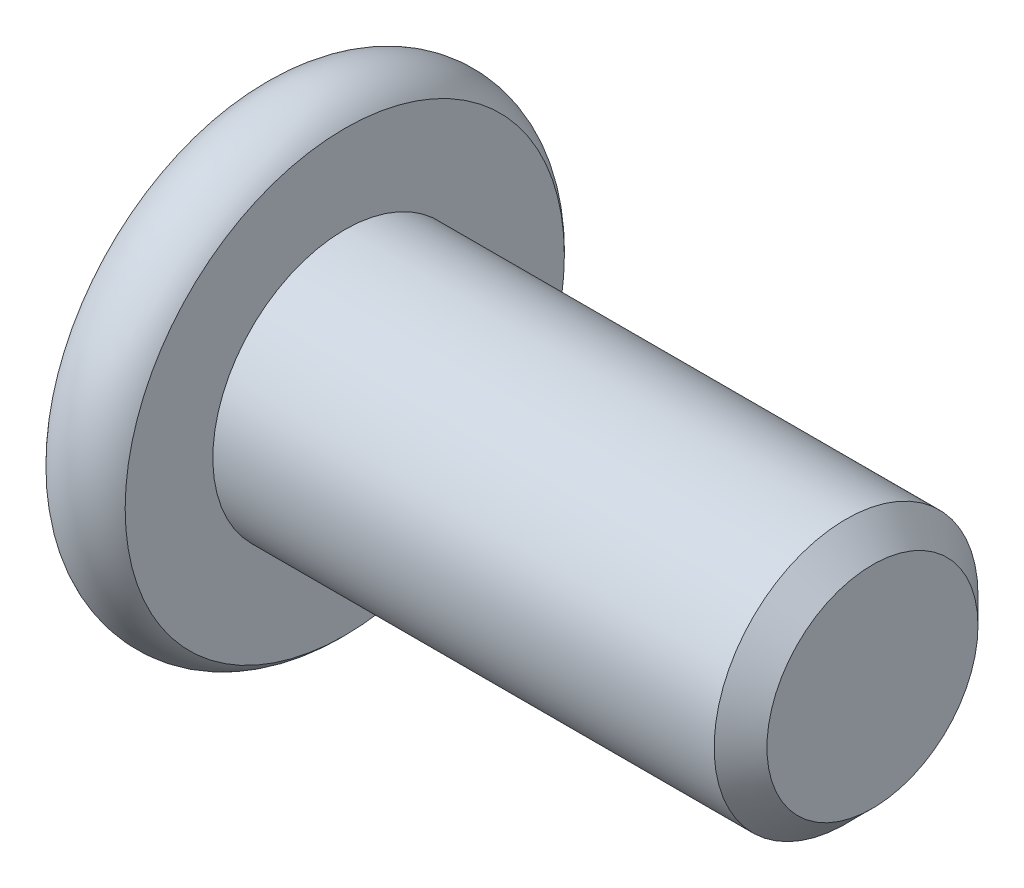
ISO-10303-21;
HEADER;
FILE_DESCRIPTION(('STEP AP214'),'2;1');
FILE_NAME('part.step','',(''),(''),'','','');
FILE_SCHEMA(('AUTOMOTIVE_DESIGN { 1 0 10303 214 1 1 1 1 }'));
ENDSEC;
DATA;
#1=APPLICATION_CONTEXT('core data for automotive mechanical design processes');
#2=APPLICATION_PROTOCOL_DEFINITION('international standard','automotive_design',2000,#1);
#3=PRODUCT_CONTEXT('',#1,'mechanical');
#4=PRODUCT('Part','Part','',(#3));
#5=PRODUCT_RELATED_PRODUCT_CATEGORY('part','',(#4));
#6=PRODUCT_DEFINITION_FORMATION('','',#4);
#7=PRODUCT_DEFINITION_CONTEXT('part definition',#1,'design');
#8=PRODUCT_DEFINITION('design','',#6,#7);
#9=PRODUCT_DEFINITION_SHAPE('','',#8);
#10=(LENGTH_UNIT() NAMED_UNIT(*) SI_UNIT(.MILLI.,.METRE.));
#11=(NAMED_UNIT(*) PLANE_ANGLE_UNIT() SI_UNIT($,.RADIAN.));
#12=(NAMED_UNIT(*) SI_UNIT($,.STERADIAN.) SOLID_ANGLE_UNIT());
#13=UNCERTAINTY_MEASURE_WITH_UNIT(LENGTH_MEASURE(1.E-05),#10,'distance_accuracy_value','');
#14=(GEOMETRIC_REPRESENTATION_CONTEXT(3) GLOBAL_UNCERTAINTY_ASSIGNED_CONTEXT((#13)) GLOBAL_UNIT_ASSIGNED_CONTEXT((#10,
#11,#12)) REPRESENTATION_CONTEXT('',''));
#15=CARTESIAN_POINT('',(0.,0.,0.));
#16=DIRECTION('',(0.,0.,1.));
#17=DIRECTION('',(1.,0.,0.));
#18=AXIS2_PLACEMENT_3D('',#15,#16,#17);
#19=CARTESIAN_POINT('',(-10.,0.,0.));
#20=DIRECTION('',(1.,0.,0.));
#21=DIRECTION('',(0.,0.,-1.));
#22=AXIS2_PLACEMENT_3D('',#19,#20,#21);
#23=CYLINDRICAL_SURFACE('',#22,2.5);
#24=CARTESIAN_POINT('',(-0.500000000000006,0.,0.));
#25=DIRECTION('',(1.,0.,0.));
#26=DIRECTION('',(0.,0.,-1.));
#27=AXIS2_PLACEMENT_3D('',#24,#25,#26);
#28=CIRCLE('',#27,2.5);
#29=CARTESIAN_POINT('',(-0.500000000000006,0.,-2.5));
#30=VERTEX_POINT('',#29);
#31=EDGE_CURVE('E48',#30,#30,#28,.F.);
#32=ORIENTED_EDGE('',*,*,#31,.T.);
#33=EDGE_LOOP('',(#32));
#34=FACE_BOUND('',#33,.T.);
#35=CARTESIAN_POINT('',(-10.,0.,0.));
#36=DIRECTION('',(1.,0.,0.));
#37=DIRECTION('',(0.,1.,0.));
#38=AXIS2_PLACEMENT_3D('',#35,#36,#37);
#39=CIRCLE('',#38,2.5);
#40=CARTESIAN_POINT('',(-10.,2.49999999999999,0.));
#41=VERTEX_POINT('',#40);
#42=EDGE_CURVE('E124',#41,#41,#39,.F.);
#43=ORIENTED_EDGE('',*,*,#42,.F.);
#44=EDGE_LOOP('',(#43));
#45=FACE_BOUND('',#44,.T.);
#46=ADVANCED_FACE('F35',(#34,#45),#23,.T.);
#47=CARTESIAN_POINT('',(0.,0.,0.));
#48=DIRECTION('',(1.,0.,0.));
#49=DIRECTION('',(0.,0.,-1.));
#50=AXIS2_PLACEMENT_3D('',#47,#48,#49);
#51=PLANE('',#50);
#52=CARTESIAN_POINT('',(0.,0.,0.));
#53=DIRECTION('',(1.,0.,0.));
#54=DIRECTION('',(0.,0.,-1.));
#55=AXIS2_PLACEMENT_3D('',#52,#53,#54);
#56=CIRCLE('',#55,1.99999999999999);
#57=CARTESIAN_POINT('',(0.,0.,-1.99999999999999));
#58=VERTEX_POINT('',#57);
#59=EDGE_CURVE('E127',#58,#58,#56,.T.);
#60=ORIENTED_EDGE('',*,*,#59,.T.);
#61=EDGE_LOOP('',(#60));
#62=FACE_BOUND('',#61,.T.);
#63=ADVANCED_FACE('F137',(#62),#51,.T.);
#64=CARTESIAN_POINT('',(0.,0.,0.));
#65=DIRECTION('',(-1.,0.,0.));
#66=DIRECTION('',(0.,0.,1.));
#67=AXIS2_PLACEMENT_3D('',#64,#65,#66);
#68=CONICAL_SURFACE('',#67,1.99999999999999,0.785398163397446);
#69=ORIENTED_EDGE('',*,*,#31,.F.);
#70=EDGE_LOOP('',(#69));
#71=FACE_BOUND('',#70,.T.);
#72=ORIENTED_EDGE('',*,*,#59,.F.);
#73=EDGE_LOOP('',(#72));
#74=FACE_BOUND('',#73,.T.);
#75=ADVANCED_FACE('F37',(#71,#74),#68,.T.);
#76=CARTESIAN_POINT('',(-11.5,0.,0.));
#77=DIRECTION('',(-1.,0.,0.));
#78=DIRECTION('',(0.,-1.,0.));
#79=AXIS2_PLACEMENT_3D('',#76,#77,#78);
#80=PLANE('',#79);
#81=CARTESIAN_POINT('',(-11.5,0.,0.));
#82=DIRECTION('',(-1.,0.,0.));
#83=DIRECTION('',(0.,-1.,0.));
#84=AXIS2_PLACEMENT_3D('',#81,#82,#83);
#85=CIRCLE('',#84,1.78205080756886);
#86=CARTESIAN_POINT('',(-11.5,-1.78205080756882,0.));
#87=VERTEX_POINT('',#86);
#88=EDGE_CURVE('E237',#87,#87,#85,.T.);
#89=ORIENTED_EDGE('',*,*,#88,.F.);
#90=EDGE_LOOP('',(#89));
#91=FACE_BOUND('',#90,.T.);
#92=CARTESIAN_POINT('',(-11.5,0.,0.));
#93=DIRECTION('',(1.,0.,0.));
#94=DIRECTION('',(0.,1.,0.));
#95=AXIS2_PLACEMENT_3D('',#92,#93,#94);
#96=CIRCLE('',#95,4.16143782776615);
#97=CARTESIAN_POINT('',(-11.5,4.16143782776615,0.));
#98=VERTEX_POINT('',#97);
#99=EDGE_CURVE('E121',#98,#98,#96,.T.);
#100=ORIENTED_EDGE('',*,*,#99,.F.);
#101=EDGE_LOOP('',(#100));
#102=FACE_BOUND('',#101,.T.);
#103=ADVANCED_FACE('F136',(#91,#102),#80,.T.);
#104=CARTESIAN_POINT('',(-10.75,0.,0.));
#105=DIRECTION('',(1.,0.,0.));
#106=DIRECTION('',(0.,1.,0.));
#107=AXIS2_PLACEMENT_3D('',#104,#105,#106);
#108=TOROIDAL_SURFACE('',#107,3.5,1.);
#109=ORIENTED_EDGE('',*,*,#99,.T.);
#110=EDGE_LOOP('',(#109));
#111=FACE_BOUND('',#110,.T.);
#112=CARTESIAN_POINT('',(-10.,0.,0.));
#113=DIRECTION('',(1.,0.,0.));
#114=DIRECTION('',(0.,1.,0.));
#115=AXIS2_PLACEMENT_3D('',#112,#113,#114);
#116=CIRCLE('',#115,4.16143782776615);
#117=CARTESIAN_POINT('',(-10.,4.16143782776615,0.));
#118=VERTEX_POINT('',#117);
#119=EDGE_CURVE('E118',#118,#118,#116,.T.);
#120=ORIENTED_EDGE('',*,*,#119,.F.);
#121=EDGE_LOOP('',(#120));
#122=FACE_BOUND('',#121,.T.);
#123=ADVANCED_FACE('F148',(#111,#122),#108,.T.);
#124=CARTESIAN_POINT('',(-10.,4.16143782776615,0.));
#125=DIRECTION('',(1.,0.,0.));
#126=DIRECTION('',(0.,1.,0.));
#127=AXIS2_PLACEMENT_3D('',#124,#125,#126);
#128=PLANE('',#127);
#129=ORIENTED_EDGE('',*,*,#42,.T.);
#130=EDGE_LOOP('',(#129));
#131=FACE_BOUND('',#130,.T.);
#132=ORIENTED_EDGE('',*,*,#119,.T.);
#133=EDGE_LOOP('',(#132));
#134=FACE_BOUND('',#133,.T.);
#135=ADVANCED_FACE('F152',(#131,#134),#128,.T.);
#136=CARTESIAN_POINT('',(-11.5,0.,0.));
#137=DIRECTION('',(-1.,0.,0.));
#138=DIRECTION('',(0.,-1.,0.));
#139=AXIS2_PLACEMENT_3D('',#136,#137,#138);
#140=CONICAL_SURFACE('',#139,1.78205080756886,0.78539816339745);
#141=ORIENTED_EDGE('',*,*,#88,.T.);
#142=EDGE_LOOP('',(#141));
#143=FACE_BOUND('',#142,.T.);
#144=CARTESIAN_POINT('',(-12.015428085613,-1.74023253176578,1.5));
#145=CARTESIAN_POINT('',(-11.9833811073445,-1.69791724929731,1.5));
#146=CARTESIAN_POINT('',(-11.9516444672841,-1.65536760966792,1.5));
#147=CARTESIAN_POINT('',(-11.8889203936153,-1.56970398156685,1.5));
#148=CARTESIAN_POINT('',(-11.85793314822,-1.52658985542849,1.5));
#149=CARTESIAN_POINT('',(-11.765846164345,-1.39562626326563,1.5));
#150=CARTESIAN_POINT('',(-11.7061145123021,-1.30679868010576,1.5));
#151=CARTESIAN_POINT('',(-11.5887342891012,-1.12044622640215,1.5));
#152=CARTESIAN_POINT('',(-11.5314082774823,-1.02271587306673,1.5));
#153=CARTESIAN_POINT('',(-11.426463214976,-0.822357214965257,1.5));
#154=CARTESIAN_POINT('',(-11.3788114236896,-0.71974693170192,1.5));
#155=CARTESIAN_POINT('',(-11.320509988315,-0.565852387095093,1.5));
#156=CARTESIAN_POINT('',(-11.3037990535409,-0.516874191424681,1.5));
#157=CARTESIAN_POINT('',(-11.2743077515089,-0.41772398845752,1.5));
#158=CARTESIAN_POINT('',(-11.2615276514219,-0.367551900263886,1.5));
#159=CARTESIAN_POINT('',(-11.2407784202458,-0.267158299056137,1.5));
#160=CARTESIAN_POINT('',(-11.2327260618259,-0.216954261864873,1.5));
#161=CARTESIAN_POINT('',(-11.221591636834,-0.115994915871338,1.5));
#162=CARTESIAN_POINT('',(-11.2185086886377,-0.0652397064615559,1.5));
#163=CARTESIAN_POINT('',(-11.2175473897404,0.0344222234875402,1.5));
#164=CARTESIAN_POINT('',(-11.2194789216952,0.0833271701100743,1.5));
#165=CARTESIAN_POINT('',(-11.2280175729677,0.180724293127207,1.5));
#166=CARTESIAN_POINT('',(-11.234625142048,0.229216429361715,1.5));
#167=CARTESIAN_POINT('',(-11.2522650626447,0.326258027696994,1.5));
#168=CARTESIAN_POINT('',(-11.263373168201,0.374793507450014,1.5));
#169=CARTESIAN_POINT('',(-11.2894198669595,0.470802295834168,1.5));
#170=CARTESIAN_POINT('',(-11.3043581560035,0.518275688481272,1.5));
#171=CARTESIAN_POINT('',(-11.356839545716,0.667150562065121,1.5));
#172=CARTESIAN_POINT('',(-11.4003351165442,0.76644836242684,1.5));
#173=CARTESIAN_POINT('',(-11.4970587814836,0.960384405673826,1.5));
#174=CARTESIAN_POINT('',(-11.5503217226675,1.0550043738362,1.5));
#175=CARTESIAN_POINT('',(-11.6602258010453,1.23584520321531,1.5));
#176=CARTESIAN_POINT('',(-11.7165682531046,1.32224986946549,1.5));
#177=CARTESIAN_POINT('',(-11.803675572597,1.44954953726472,1.5));
#178=CARTESIAN_POINT('',(-11.8330199906839,1.49143368482422,1.5));
#179=CARTESIAN_POINT('',(-11.8924869182931,1.57462914783243,1.5));
#180=CARTESIAN_POINT('',(-11.9226092115007,1.61594061772578,1.5));
#181=CARTESIAN_POINT('',(-11.9530541181366,1.65701358742552,1.5));
#182=B_SPLINE_CURVE_WITH_KNOTS('',3,(#144,#145,#146,#147,#148,#149,#150,#151,#152,#153,#154,
#155,#156,#157,#158,#159,#160,#161,#162,#163,#164,#165,#166,#167,#168,#169,#170,#171,#172,#173,
#174,#175,#176,#177,#178,#179,#180,#181),.UNSPECIFIED.,.F.,.F.,(4,2,2,2,2,2,2,2,2,2,2,2,2,2,2,2,
2,2,4),(0.,0.159238974218354,0.318517535014543,0.639504781932391,0.979137893799203,
1.31760168934357,1.47272233841624,1.62785352839776,1.78016486537347,1.93244917778279,
2.07904486260298,2.22565464958333,2.37484213303399,2.5240177730404,2.84828365283776,
3.1737297566675,3.48303030530537,3.63644667013909,3.78982082222913),.UNSPECIFIED.);
#183=CARTESIAN_POINT('',(-11.45,-0.866025403784395,1.5));
#184=VERTEX_POINT('',#183);
#185=CARTESIAN_POINT('',(-11.45,0.866025403784483,1.5));
#186=VERTEX_POINT('',#185);
#187=EDGE_CURVE('E102',#184,#186,#182,.T.);
#188=ORIENTED_EDGE('',*,*,#187,.F.);
#189=CARTESIAN_POINT('',(-11.4501154816001,-1.73216627762267,-0.000200000000000713));
#190=CARTESIAN_POINT('',(-11.4203654760674,-1.70239359975911,0.0513677907370752));
#191=CARTESIAN_POINT('',(-11.3923624839103,-1.67212305186351,0.103797917665201));
#192=CARTESIAN_POINT('',(-11.3410892304402,-1.61039789003615,0.210709034055597));
#193=CARTESIAN_POINT('',(-11.3178475050444,-1.5789374031261,0.265200195814661));
#194=CARTESIAN_POINT('',(-11.2780337289922,-1.51549879897983,0.375079081357248));
#195=CARTESIAN_POINT('',(-11.2613615856709,-1.48353684526806,0.430438809095199));
#196=CARTESIAN_POINT('',(-11.2356744568181,-1.41890915196207,0.542377257477151));
#197=CARTESIAN_POINT('',(-11.2266402904789,-1.38624538781114,0.598952556553009));
#198=CARTESIAN_POINT('',(-11.2184890812269,-1.32995210095295,0.696455389516441));
#199=CARTESIAN_POINT('',(-11.2172822529892,-1.3063953331112,0.737256908280466));
#200=CARTESIAN_POINT('',(-11.2193140571623,-1.25932335290189,0.818787969615858));
#201=CARTESIAN_POINT('',(-11.2225536707483,-1.23580815085309,0.85951749431463));
#202=CARTESIAN_POINT('',(-11.233291985982,-1.18900414978422,0.940584402163416));
#203=CARTESIAN_POINT('',(-11.2407946530188,-1.16571558211715,0.980921384598288));
#204=CARTESIAN_POINT('',(-11.2596516119283,-1.11952932016331,1.06091833691403));
#205=CARTESIAN_POINT('',(-11.2710075570186,-1.09663179808782,1.10057800851621));
#206=CARTESIAN_POINT('',(-11.3047216475927,-1.03798159809694,1.20216313477448));
#207=CARTESIAN_POINT('',(-11.3296218490934,-1.00259267147461,1.26345855370969));
#208=CARTESIAN_POINT('',(-11.3716566532716,-0.950557780604331,1.35358562846331));
#209=CARTESIAN_POINT('',(-11.3864251535591,-0.933410759677104,1.38328513990772));
#210=CARTESIAN_POINT('',(-11.4173105659402,-0.899432101996364,1.44213790138375));
#211=CARTESIAN_POINT('',(-11.4334268341217,-0.882600319285667,1.47129140422064));
#212=CARTESIAN_POINT('',(-11.4501154816001,-0.865909933730557,1.5002));
#213=B_SPLINE_CURVE_WITH_KNOTS('',3,(#189,#190,#191,#192,#193,#194,#195,#196,#197,#198,#199,
#200,#201,#202,#203,#204,#205,#206,#207,#208,#209,#210,#211,#212),.UNSPECIFIED.,.F.,.F.,(4,2,2,
2,2,2,2,2,2,2,2,4),(0.,0.199829143693305,0.400822987382389,0.598623720538181,0.79592624018889,
0.937113067959882,1.07833105577193,1.21968061668222,1.36109089931054,1.58570969637565,
1.69770705470964,1.80965120737194),.UNSPECIFIED.);
#214=CARTESIAN_POINT('',(-11.45,-1.73205080756883,0.));
#215=VERTEX_POINT('',#214);
#216=EDGE_CURVE('E194',#215,#184,#213,.T.);
#217=ORIENTED_EDGE('',*,*,#216,.F.);
#218=CARTESIAN_POINT('',(-11.4501154816001,-0.865909933730557,-1.5002));
#219=CARTESIAN_POINT('',(-11.4203654760673,-0.895682611594122,-1.44863220926292));
#220=CARTESIAN_POINT('',(-11.3923624839103,-0.925953159489721,-1.3962020823348));
#221=CARTESIAN_POINT('',(-11.3410892304402,-0.98767832131708,-1.2892909659444));
#222=CARTESIAN_POINT('',(-11.3178475050444,-1.01913880822713,-1.23479980418534));
#223=CARTESIAN_POINT('',(-11.2780337289922,-1.0825774123734,-1.12492091864275));
#224=CARTESIAN_POINT('',(-11.2613615856709,-1.11453936608517,-1.0695611909048));
#225=CARTESIAN_POINT('',(-11.2356744568181,-1.17916705939116,-0.957622742522848));
#226=CARTESIAN_POINT('',(-11.2266402904789,-1.21183082354209,-0.90104744344699));
#227=CARTESIAN_POINT('',(-11.2184890812269,-1.26812411040028,-0.803544610483558));
#228=CARTESIAN_POINT('',(-11.2172822529892,-1.29168087824203,-0.762743091719532));
#229=CARTESIAN_POINT('',(-11.2193140571623,-1.33875285845134,-0.68121203038414));
#230=CARTESIAN_POINT('',(-11.2225536707483,-1.36226806050014,-0.640482505685369));
#231=CARTESIAN_POINT('',(-11.233291985982,-1.40907206156901,-0.559415597836583));
#232=CARTESIAN_POINT('',(-11.2407946530188,-1.43236062923608,-0.519078615401711));
#233=CARTESIAN_POINT('',(-11.2596516119283,-1.47854689118992,-0.439081663085968));
#234=CARTESIAN_POINT('',(-11.2710075570186,-1.50144441326541,-0.399421991483791));
#235=CARTESIAN_POINT('',(-11.3047216475927,-1.56009461325629,-0.297836865225514));
#236=CARTESIAN_POINT('',(-11.3296218490934,-1.59548353987862,-0.23654144629031));
#237=CARTESIAN_POINT('',(-11.3716566532716,-1.6475184307489,-0.146414371536686));
#238=CARTESIAN_POINT('',(-11.3864251535591,-1.66466545167613,-0.116714860092282));
#239=CARTESIAN_POINT('',(-11.4173105659402,-1.69864410935687,-0.0578620986162491));
#240=CARTESIAN_POINT('',(-11.4334268341217,-1.71547589206756,-0.0287085957793631));
#241=CARTESIAN_POINT('',(-11.4501154816001,-1.73216627762267,0.000199999999999294));
#242=B_SPLINE_CURVE_WITH_KNOTS('',3,(#218,#219,#220,#221,#222,#223,#224,#225,#226,#227,#228,
#229,#230,#231,#232,#233,#234,#235,#236,#237,#238,#239,#240,#241),.UNSPECIFIED.,.F.,.F.,(4,2,2,
2,2,2,2,2,2,2,2,4),(0.,0.199829143693305,0.40082298738239,0.598623720538182,0.795926240188891,
0.937113067959883,1.07833105577193,1.21968061668222,1.36109089931055,1.58570969637566,
1.69770705470964,1.80965120737194),.UNSPECIFIED.);
#243=CARTESIAN_POINT('',(-11.45,-0.866025403784394,-1.5));
#244=VERTEX_POINT('',#243);
#245=EDGE_CURVE('E189',#244,#215,#242,.T.);
#246=ORIENTED_EDGE('',*,*,#245,.F.);
#247=CARTESIAN_POINT('',(-12.015428085613,-1.74023253176577,-1.5));
#248=CARTESIAN_POINT('',(-11.9833811073445,-1.69791724929731,-1.5));
#249=CARTESIAN_POINT('',(-11.9516444672841,-1.65536760966792,-1.5));
#250=CARTESIAN_POINT('',(-11.8889203936153,-1.56970398156685,-1.5));
#251=CARTESIAN_POINT('',(-11.85793314822,-1.52658985542849,-1.5));
#252=CARTESIAN_POINT('',(-11.765846164345,-1.39562626326563,-1.5));
#253=CARTESIAN_POINT('',(-11.7061145123021,-1.30679868010576,-1.5));
#254=CARTESIAN_POINT('',(-11.5887342891012,-1.12044622640215,-1.5));
#255=CARTESIAN_POINT('',(-11.5314082774823,-1.02271587306672,-1.5));
#256=CARTESIAN_POINT('',(-11.426463214976,-0.822357214965256,-1.5));
#257=CARTESIAN_POINT('',(-11.3788114236896,-0.719746931701919,-1.5));
#258=CARTESIAN_POINT('',(-11.320509988315,-0.565852387095092,-1.5));
#259=CARTESIAN_POINT('',(-11.3037990535409,-0.51687419142468,-1.5));
#260=CARTESIAN_POINT('',(-11.2743077515089,-0.417723988457519,-1.5));
#261=CARTESIAN_POINT('',(-11.2615276514219,-0.367551900263885,-1.5));
#262=CARTESIAN_POINT('',(-11.2407784202458,-0.267158299056136,-1.5));
#263=CARTESIAN_POINT('',(-11.2327260618259,-0.216954261864872,-1.5));
#264=CARTESIAN_POINT('',(-11.221591636834,-0.115994915871338,-1.5));
#265=CARTESIAN_POINT('',(-11.2185086886377,-0.0652397064615554,-1.5));
#266=CARTESIAN_POINT('',(-11.2175473897404,0.0344222234875406,-1.5));
#267=CARTESIAN_POINT('',(-11.2194789216952,0.0833271701100747,-1.5));
#268=CARTESIAN_POINT('',(-11.2280175729677,0.180724293127208,-1.5));
#269=CARTESIAN_POINT('',(-11.234625142048,0.229216429361715,-1.5));
#270=CARTESIAN_POINT('',(-11.2522650626447,0.326258027696995,-1.5));
#271=CARTESIAN_POINT('',(-11.263373168201,0.374793507450015,-1.5));
#272=CARTESIAN_POINT('',(-11.2894198669595,0.470802295834169,-1.5));
#273=CARTESIAN_POINT('',(-11.3043581560035,0.518275688481272,-1.5));
#274=CARTESIAN_POINT('',(-11.356839545716,0.667150562065121,-1.5));
#275=CARTESIAN_POINT('',(-11.4003351165442,0.766448362426841,-1.5));
#276=CARTESIAN_POINT('',(-11.4970587814836,0.960384405673827,-1.5));
#277=CARTESIAN_POINT('',(-11.5503217226675,1.0550043738362,-1.5));
#278=CARTESIAN_POINT('',(-11.6602258010453,1.23584520321531,-1.5));
#279=CARTESIAN_POINT('',(-11.7165682531046,1.32224986946549,-1.5));
#280=CARTESIAN_POINT('',(-11.803675572597,1.44954953726472,-1.5));
#281=CARTESIAN_POINT('',(-11.8330199906839,1.49143368482422,-1.5));
#282=CARTESIAN_POINT('',(-11.8924869182931,1.57462914783243,-1.5));
#283=CARTESIAN_POINT('',(-11.9226092115007,1.61594061772578,-1.5));
#284=CARTESIAN_POINT('',(-11.9530541181366,1.65701358742552,-1.5));
#285=B_SPLINE_CURVE_WITH_KNOTS('',3,(#247,#248,#249,#250,#251,#252,#253,#254,#255,#256,#257,
#258,#259,#260,#261,#262,#263,#264,#265,#266,#267,#268,#269,#270,#271,#272,#273,#274,#275,#276,
#277,#278,#279,#280,#281,#282,#283,#284),.UNSPECIFIED.,.F.,.F.,(4,2,2,2,2,2,2,2,2,2,2,2,2,2,2,2,
2,2,4),(0.,0.159238974218353,0.318517535014542,0.639504781932388,0.979137893799199,
1.31760168934357,1.47272233841624,1.62785352839775,1.78016486537346,1.93244917778279,
2.07904486260297,2.22565464958332,2.37484213303399,2.5240177730404,2.84828365283775,
3.1737297566675,3.48303030530537,3.63644667013908,3.78982082222912),.UNSPECIFIED.);
#286=CARTESIAN_POINT('',(-11.45,0.866025403784483,-1.5));
#287=VERTEX_POINT('',#286);
#288=EDGE_CURVE('E55',#287,#244,#285,.F.);
#289=ORIENTED_EDGE('',*,*,#288,.F.);
#290=CARTESIAN_POINT('',(-11.4501154816001,1.73216627762276,0.000200000000000434));
#291=CARTESIAN_POINT('',(-11.4203654760673,1.70239359975919,-0.0513677907370751));
#292=CARTESIAN_POINT('',(-11.3923624839103,1.67212305186359,-0.1037979176652));
#293=CARTESIAN_POINT('',(-11.3410892304402,1.61039789003624,-0.210709034055596));
#294=CARTESIAN_POINT('',(-11.3178475050444,1.57893740312618,-0.265200195814661));
#295=CARTESIAN_POINT('',(-11.2780337289922,1.51549879897992,-0.375079081357248));
#296=CARTESIAN_POINT('',(-11.2613615856709,1.48353684526815,-0.430438809095199));
#297=CARTESIAN_POINT('',(-11.2356744568181,1.41890915196216,-0.54237725747715));
#298=CARTESIAN_POINT('',(-11.2266402904789,1.38624538781123,-0.598952556553008));
#299=CARTESIAN_POINT('',(-11.2184890812269,1.32995210095304,-0.69645538951644));
#300=CARTESIAN_POINT('',(-11.2172822529892,1.30639533311128,-0.737256908280466));
#301=CARTESIAN_POINT('',(-11.2193140571623,1.25932335290198,-0.818787969615858));
#302=CARTESIAN_POINT('',(-11.2225536707483,1.23580815085318,-0.859517494314629));
#303=CARTESIAN_POINT('',(-11.233291985982,1.18900414978431,-0.940584402163415));
#304=CARTESIAN_POINT('',(-11.2407946530187,1.16571558211724,-0.980921384598287));
#305=CARTESIAN_POINT('',(-11.2596516119283,1.1195293201634,-1.06091833691403));
#306=CARTESIAN_POINT('',(-11.2710075570186,1.09663179808791,-1.10057800851621));
#307=CARTESIAN_POINT('',(-11.3047216475927,1.03798159809703,-1.20216313477448));
#308=CARTESIAN_POINT('',(-11.3296218490934,1.0025926714747,-1.26345855370969));
#309=CARTESIAN_POINT('',(-11.3716566532716,0.950557780604418,-1.35358562846331));
#310=CARTESIAN_POINT('',(-11.3864251535591,0.933410759677191,-1.38328513990772));
#311=CARTESIAN_POINT('',(-11.4173105659402,0.899432101996451,-1.44213790138375));
#312=CARTESIAN_POINT('',(-11.4334268341217,0.882600319285755,-1.47129140422064));
#313=CARTESIAN_POINT('',(-11.4501154816001,0.865909933730645,-1.5002));
#314=B_SPLINE_CURVE_WITH_KNOTS('',3,(#290,#291,#292,#293,#294,#295,#296,#297,#298,#299,#300,
#301,#302,#303,#304,#305,#306,#307,#308,#309,#310,#311,#312,#313),.UNSPECIFIED.,.F.,.F.,(4,2,2,
2,2,2,2,2,2,2,2,4),(0.,0.199829143693305,0.400822987382389,0.598623720538181,0.795926240188889,
0.937113067959881,1.07833105577193,1.21968061668222,1.36109089931054,1.58570969637565,
1.69770705470964,1.80965120737194),.UNSPECIFIED.);
#315=CARTESIAN_POINT('',(-11.45,1.73205080756892,0.));
#316=VERTEX_POINT('',#315);
#317=EDGE_CURVE('E11',#316,#287,#314,.T.);
#318=ORIENTED_EDGE('',*,*,#317,.F.);
#319=CARTESIAN_POINT('',(-11.4501154816001,0.865909933730645,1.5002));
#320=CARTESIAN_POINT('',(-11.4203654760673,0.89568261159421,1.44863220926292));
#321=CARTESIAN_POINT('',(-11.3923624839103,0.925953159489809,1.3962020823348));
#322=CARTESIAN_POINT('',(-11.3410892304402,0.987678321317167,1.2892909659444));
#323=CARTESIAN_POINT('',(-11.3178475050444,1.01913880822722,1.23479980418534));
#324=CARTESIAN_POINT('',(-11.2780337289922,1.08257741237349,1.12492091864275));
#325=CARTESIAN_POINT('',(-11.2613615856709,1.11453936608526,1.0695611909048));
#326=CARTESIAN_POINT('',(-11.2356744568181,1.17916705939125,0.957622742522851));
#327=CARTESIAN_POINT('',(-11.2266402904789,1.21183082354218,0.901047443446993));
#328=CARTESIAN_POINT('',(-11.2184890812269,1.26812411040036,0.803544610483561));
#329=CARTESIAN_POINT('',(-11.2172822529892,1.29168087824212,0.762743091719535));
#330=CARTESIAN_POINT('',(-11.2193140571623,1.33875285845142,0.681212030384143));
#331=CARTESIAN_POINT('',(-11.2225536707483,1.36226806050023,0.640482505685371));
#332=CARTESIAN_POINT('',(-11.233291985982,1.40907206156909,0.559415597836585));
#333=CARTESIAN_POINT('',(-11.2407946530187,1.43236062923616,0.519078615401713));
#334=CARTESIAN_POINT('',(-11.2596516119283,1.47854689119001,0.43908166308597));
#335=CARTESIAN_POINT('',(-11.2710075570186,1.5014444132655,0.399421991483793));
#336=CARTESIAN_POINT('',(-11.3047216475927,1.56009461325637,0.297836865225516));
#337=CARTESIAN_POINT('',(-11.3296218490934,1.59548353987871,0.236541446290312));
#338=CARTESIAN_POINT('',(-11.3716566532716,1.64751843074898,0.146414371536687));
#339=CARTESIAN_POINT('',(-11.3864251535591,1.66466545167621,0.116714860092283));
#340=CARTESIAN_POINT('',(-11.4173105659402,1.69864410935695,0.0578620986162497));
#341=CARTESIAN_POINT('',(-11.4334268341217,1.71547589206765,0.0287085957793635));
#342=CARTESIAN_POINT('',(-11.4501154816001,1.73216627762276,-0.000199999999999224));
#343=B_SPLINE_CURVE_WITH_KNOTS('',3,(#319,#320,#321,#322,#323,#324,#325,#326,#327,#328,#329,
#330,#331,#332,#333,#334,#335,#336,#337,#338,#339,#340,#341,#342),.UNSPECIFIED.,.F.,.F.,(4,2,2,
2,2,2,2,2,2,2,2,4),(0.,0.199829143693304,0.400822987382388,0.598623720538179,0.795926240188887,
0.937113067959879,1.07833105577193,1.21968061668222,1.36109089931054,1.58570969637565,
1.69770705470963,1.80965120737194),.UNSPECIFIED.);
#344=EDGE_CURVE('E93',#186,#316,#343,.T.);
#345=ORIENTED_EDGE('',*,*,#344,.F.);
#346=EDGE_LOOP('',(#188,#217,#246,#289,#318,#345));
#347=FACE_BOUND('',#346,.T.);
#348=ADVANCED_FACE('F92',(#143,#347),#140,.F.);
#349=CARTESIAN_POINT('',(-9.2,0.,0.));
#350=DIRECTION('',(-1.,0.,0.));
#351=DIRECTION('',(0.,-1.,0.));
#352=AXIS2_PLACEMENT_3D('',#349,#350,#351);
#353=PLANE('',#352);
#354=DIRECTION('',(0.,0.5,-0.866025403784439));
#355=VECTOR('',#354,1.);
#356=CARTESIAN_POINT('',(-9.2,0.866025403784474,1.5));
#357=LINE('',#356,#355);
#358=CARTESIAN_POINT('',(-9.2,0.866025403784474,1.5));
#359=VERTEX_POINT('',#358);
#360=CARTESIAN_POINT('',(-9.19999999999999,1.73205080756891,0.));
#361=VERTEX_POINT('',#360);
#362=EDGE_CURVE('E101',#359,#361,#357,.T.);
#363=ORIENTED_EDGE('',*,*,#362,.T.);
#364=DIRECTION('',(0.,-0.5,-0.866025403784439));
#365=VECTOR('',#364,1.);
#366=CARTESIAN_POINT('',(-9.19999999999999,1.73205080756891,0.));
#367=LINE('',#366,#365);
#368=CARTESIAN_POINT('',(-9.2,0.866025403784474,-1.5));
#369=VERTEX_POINT('',#368);
#370=EDGE_CURVE('E106',#361,#369,#367,.T.);
#371=ORIENTED_EDGE('',*,*,#370,.T.);
#372=DIRECTION('',(0.,-1.,0.));
#373=VECTOR('',#372,1.);
#374=CARTESIAN_POINT('',(-9.2,0.866025403784474,-1.5));
#375=LINE('',#374,#373);
#376=CARTESIAN_POINT('',(-9.2,-0.866025403784403,-1.5));
#377=VERTEX_POINT('',#376);
#378=EDGE_CURVE('E219',#369,#377,#375,.T.);
#379=ORIENTED_EDGE('',*,*,#378,.T.);
#380=DIRECTION('',(0.,-0.5,0.866025403784438));
#381=VECTOR('',#380,1.);
#382=CARTESIAN_POINT('',(-9.2,-0.866025403784403,-1.5));
#383=LINE('',#382,#381);
#384=CARTESIAN_POINT('',(-9.20000000000001,-1.73205080756884,0.));
#385=VERTEX_POINT('',#384);
#386=EDGE_CURVE('E223',#377,#385,#383,.T.);
#387=ORIENTED_EDGE('',*,*,#386,.T.);
#388=DIRECTION('',(0.,0.5,0.866025403784439));
#389=VECTOR('',#388,1.);
#390=CARTESIAN_POINT('',(-9.20000000000001,-1.73205080756884,0.));
#391=LINE('',#390,#389);
#392=CARTESIAN_POINT('',(-9.2,-0.866025403784404,1.5));
#393=VERTEX_POINT('',#392);
#394=EDGE_CURVE('E114',#385,#393,#391,.T.);
#395=ORIENTED_EDGE('',*,*,#394,.T.);
#396=DIRECTION('',(0.,1.,0.));
#397=VECTOR('',#396,1.);
#398=CARTESIAN_POINT('',(-9.2,-0.866025403784404,1.5));
#399=LINE('',#398,#397);
#400=EDGE_CURVE('E109',#393,#359,#399,.T.);
#401=ORIENTED_EDGE('',*,*,#400,.T.);
#402=EDGE_LOOP('',(#363,#371,#379,#387,#395,#401));
#403=FACE_BOUND('',#402,.T.);
#404=ADVANCED_FACE('F176',(#403),#353,.T.);
#405=CARTESIAN_POINT('',(-9.19999999999999,1.73205080756891,0.));
#406=DIRECTION('',(0.,0.866025403784439,-0.5));
#407=DIRECTION('',(0.,0.5,0.866025403784439));
#408=AXIS2_PLACEMENT_3D('',#405,#406,#407);
#409=PLANE('',#408);
#410=DIRECTION('',(-1.,0.,0.));
#411=VECTOR('',#410,1.);
#412=CARTESIAN_POINT('',(-9.19999999999999,1.73205080756891,0.));
#413=LINE('',#412,#411);
#414=EDGE_CURVE('E99',#361,#316,#413,.T.);
#415=ORIENTED_EDGE('',*,*,#414,.T.);
#416=ORIENTED_EDGE('',*,*,#317,.T.);
#417=DIRECTION('',(-1.,0.,0.));
#418=VECTOR('',#417,1.);
#419=CARTESIAN_POINT('',(-9.2,0.866025403784474,-1.5));
#420=LINE('',#419,#418);
#421=EDGE_CURVE('E108',#369,#287,#420,.T.);
#422=ORIENTED_EDGE('',*,*,#421,.F.);
#423=ORIENTED_EDGE('',*,*,#370,.F.);
#424=EDGE_LOOP('',(#415,#416,#422,#423));
#425=FACE_BOUND('',#424,.T.);
#426=ADVANCED_FACE('F104',(#425),#409,.F.);
#427=CARTESIAN_POINT('',(-9.2,0.866025403784474,-1.5));
#428=DIRECTION('',(0.,0.,-1.));
#429=DIRECTION('',(-1.,0.,0.));
#430=AXIS2_PLACEMENT_3D('',#427,#428,#429);
#431=PLANE('',#430);
#432=ORIENTED_EDGE('',*,*,#421,.T.);
#433=ORIENTED_EDGE('',*,*,#288,.T.);
#434=DIRECTION('',(-1.,0.,0.));
#435=VECTOR('',#434,1.);
#436=CARTESIAN_POINT('',(-9.2,-0.866025403784403,-1.5));
#437=LINE('',#436,#435);
#438=EDGE_CURVE('E111',#377,#244,#437,.T.);
#439=ORIENTED_EDGE('',*,*,#438,.F.);
#440=ORIENTED_EDGE('',*,*,#378,.F.);
#441=EDGE_LOOP('',(#432,#433,#439,#440));
#442=FACE_BOUND('',#441,.T.);
#443=ADVANCED_FACE('F208',(#442),#431,.F.);
#444=CARTESIAN_POINT('',(-9.2,-0.866025403784403,-1.5));
#445=DIRECTION('',(0.,-0.866025403784439,-0.5));
#446=DIRECTION('',(0.,0.5,-0.866025403784439));
#447=AXIS2_PLACEMENT_3D('',#444,#445,#446);
#448=PLANE('',#447);
#449=ORIENTED_EDGE('',*,*,#438,.T.);
#450=ORIENTED_EDGE('',*,*,#245,.T.);
#451=DIRECTION('',(-1.,0.,0.));
#452=VECTOR('',#451,1.);
#453=CARTESIAN_POINT('',(-9.20000000000001,-1.73205080756884,0.));
#454=LINE('',#453,#452);
#455=EDGE_CURVE('E233',#385,#215,#454,.T.);
#456=ORIENTED_EDGE('',*,*,#455,.F.);
#457=ORIENTED_EDGE('',*,*,#386,.F.);
#458=EDGE_LOOP('',(#449,#450,#456,#457));
#459=FACE_BOUND('',#458,.T.);
#460=ADVANCED_FACE('F203',(#459),#448,.F.);
#461=CARTESIAN_POINT('',(-9.20000000000001,-1.73205080756884,0.));
#462=DIRECTION('',(0.,-0.866025403784439,0.5));
#463=DIRECTION('',(0.,-0.5,-0.866025403784439));
#464=AXIS2_PLACEMENT_3D('',#461,#462,#463);
#465=PLANE('',#464);
#466=ORIENTED_EDGE('',*,*,#455,.T.);
#467=ORIENTED_EDGE('',*,*,#216,.T.);
#468=DIRECTION('',(-1.,0.,0.));
#469=VECTOR('',#468,1.);
#470=CARTESIAN_POINT('',(-9.2,-0.866025403784404,1.5));
#471=LINE('',#470,#469);
#472=EDGE_CURVE('E230',#393,#184,#471,.T.);
#473=ORIENTED_EDGE('',*,*,#472,.F.);
#474=ORIENTED_EDGE('',*,*,#394,.F.);
#475=EDGE_LOOP('',(#466,#467,#473,#474));
#476=FACE_BOUND('',#475,.T.);
#477=ADVANCED_FACE('F200',(#476),#465,.F.);
#478=CARTESIAN_POINT('',(-9.2,-0.866025403784404,1.5));
#479=DIRECTION('',(0.,0.,1.));
#480=DIRECTION('',(1.,0.,0.));
#481=AXIS2_PLACEMENT_3D('',#478,#479,#480);
#482=PLANE('',#481);
#483=ORIENTED_EDGE('',*,*,#472,.T.);
#484=ORIENTED_EDGE('',*,*,#187,.T.);
#485=DIRECTION('',(-1.,0.,0.));
#486=VECTOR('',#485,1.);
#487=CARTESIAN_POINT('',(-9.2,0.866025403784474,1.5));
#488=LINE('',#487,#486);
#489=EDGE_CURVE('E62',#359,#186,#488,.T.);
#490=ORIENTED_EDGE('',*,*,#489,.F.);
#491=ORIENTED_EDGE('',*,*,#400,.F.);
#492=EDGE_LOOP('',(#483,#484,#490,#491));
#493=FACE_BOUND('',#492,.T.);
#494=ADVANCED_FACE('F159',(#493),#482,.F.);
#495=CARTESIAN_POINT('',(-9.2,0.866025403784474,1.5));
#496=DIRECTION('',(0.,0.866025403784439,0.5));
#497=DIRECTION('',(0.,-0.5,0.866025403784439));
#498=AXIS2_PLACEMENT_3D('',#495,#496,#497);
#499=PLANE('',#498);
#500=ORIENTED_EDGE('',*,*,#489,.T.);
#501=ORIENTED_EDGE('',*,*,#344,.T.);
#502=ORIENTED_EDGE('',*,*,#414,.F.);
#503=ORIENTED_EDGE('',*,*,#362,.F.);
#504=EDGE_LOOP('',(#500,#501,#502,#503));
#505=FACE_BOUND('',#504,.T.);
#506=ADVANCED_FACE('F98',(#505),#499,.F.);
#507=CLOSED_SHELL('',(#46,#63,#75,#103,#123,#135,#348,#404,#426,#443,#460,#477,#494,#506));
#508=MANIFOLD_SOLID_BREP('B2',#507);
#509=ADVANCED_BREP_SHAPE_REPRESENTATION('',(#18,#508),#14);
#510=SHAPE_DEFINITION_REPRESENTATION(#9,#509);
ENDSEC;
END-ISO-10303-21;
